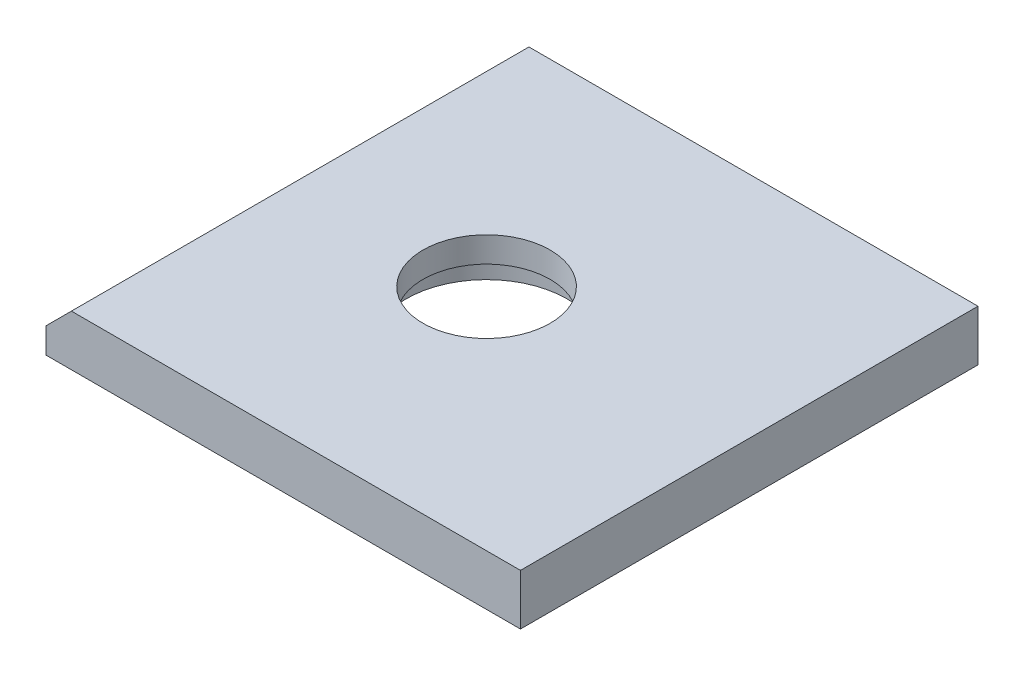
ISO-10303-21;
HEADER;
FILE_DESCRIPTION(('STEP AP214'),'2;1');
FILE_NAME('part.step','',(''),(''),'','','');
FILE_SCHEMA(('AUTOMOTIVE_DESIGN { 1 0 10303 214 1 1 1 1 }'));
ENDSEC;
DATA;
#1=APPLICATION_CONTEXT('core data for automotive mechanical design processes');
#2=APPLICATION_PROTOCOL_DEFINITION('international standard','automotive_design',2000,#1);
#3=PRODUCT_CONTEXT('',#1,'mechanical');
#4=PRODUCT('Part','Part','',(#3));
#5=PRODUCT_RELATED_PRODUCT_CATEGORY('part','',(#4));
#6=PRODUCT_DEFINITION_FORMATION('','',#4);
#7=PRODUCT_DEFINITION_CONTEXT('part definition',#1,'design');
#8=PRODUCT_DEFINITION('design','',#6,#7);
#9=PRODUCT_DEFINITION_SHAPE('','',#8);
#10=(LENGTH_UNIT() NAMED_UNIT(*) SI_UNIT(.MILLI.,.METRE.));
#11=(NAMED_UNIT(*) PLANE_ANGLE_UNIT() SI_UNIT($,.RADIAN.));
#12=(NAMED_UNIT(*) SI_UNIT($,.STERADIAN.) SOLID_ANGLE_UNIT());
#13=UNCERTAINTY_MEASURE_WITH_UNIT(LENGTH_MEASURE(1.E-05),#10,'distance_accuracy_value','');
#14=(GEOMETRIC_REPRESENTATION_CONTEXT(3) GLOBAL_UNCERTAINTY_ASSIGNED_CONTEXT((#13)) GLOBAL_UNIT_ASSIGNED_CONTEXT((#10,
#11,#12)) REPRESENTATION_CONTEXT('',''));
#15=CARTESIAN_POINT('',(0.,0.,0.));
#16=DIRECTION('',(0.,0.,1.));
#17=DIRECTION('',(1.,0.,0.));
#18=AXIS2_PLACEMENT_3D('',#15,#16,#17);
#19=CARTESIAN_POINT('',(-3.,3.,0.));
#20=DIRECTION('',(0.,-1.,0.));
#21=DIRECTION('',(0.,0.,-1.));
#22=AXIS2_PLACEMENT_3D('',#19,#20,#21);
#23=CYLINDRICAL_SURFACE('',#22,7.5);
#24=CARTESIAN_POINT('',(-3.,3.,0.));
#25=DIRECTION('',(0.,-1.,0.));
#26=DIRECTION('',(0.,0.,-1.));
#27=AXIS2_PLACEMENT_3D('',#24,#25,#26);
#28=CIRCLE('',#27,7.5);
#29=CARTESIAN_POINT('',(-3.,3.,-7.5));
#30=VERTEX_POINT('',#29);
#31=EDGE_CURVE('E78',#30,#30,#28,.F.);
#32=ORIENTED_EDGE('',*,*,#31,.F.);
#33=EDGE_LOOP('',(#32));
#34=FACE_BOUND('',#33,.T.);
#35=CARTESIAN_POINT('',(-3.,6.,0.));
#36=DIRECTION('',(0.,-1.,0.));
#37=DIRECTION('',(0.,0.,-1.));
#38=AXIS2_PLACEMENT_3D('',#35,#36,#37);
#39=CIRCLE('',#38,7.5);
#40=CARTESIAN_POINT('',(-3.,6.,-7.5));
#41=VERTEX_POINT('',#40);
#42=EDGE_CURVE('E20',#41,#41,#39,.T.);
#43=ORIENTED_EDGE('',*,*,#42,.F.);
#44=EDGE_LOOP('',(#43));
#45=FACE_BOUND('',#44,.T.);
#46=ADVANCED_FACE('F17',(#34,#45),#23,.F.);
#47=CARTESIAN_POINT('',(0.,6.,0.));
#48=DIRECTION('',(0.,1.,0.));
#49=DIRECTION('',(0.,0.,1.));
#50=AXIS2_PLACEMENT_3D('',#47,#48,#49);
#51=PLANE('',#50);
#52=ORIENTED_EDGE('',*,*,#42,.T.);
#53=EDGE_LOOP('',(#52));
#54=FACE_BOUND('',#53,.T.);
#55=DIRECTION('',(-1.,0.,0.));
#56=VECTOR('',#55,1.);
#57=CARTESIAN_POINT('',(28.,6.,-27.));
#58=LINE('',#57,#56);
#59=CARTESIAN_POINT('',(-25.,6.,-27.));
#60=VERTEX_POINT('',#59);
#61=CARTESIAN_POINT('',(28.,6.,-27.));
#62=VERTEX_POINT('',#61);
#63=EDGE_CURVE('E111',#60,#62,#58,.F.);
#64=ORIENTED_EDGE('',*,*,#63,.F.);
#65=DIRECTION('',(0.,0.,1.));
#66=VECTOR('',#65,1.);
#67=CARTESIAN_POINT('',(-25.,6.,0.));
#68=LINE('',#67,#66);
#69=CARTESIAN_POINT('',(-25.,6.,27.));
#70=VERTEX_POINT('',#69);
#71=EDGE_CURVE('E91',#70,#60,#68,.F.);
#72=ORIENTED_EDGE('',*,*,#71,.F.);
#73=DIRECTION('',(1.,0.,0.));
#74=VECTOR('',#73,1.);
#75=CARTESIAN_POINT('',(-28.,6.,27.));
#76=LINE('',#75,#74);
#77=CARTESIAN_POINT('',(28.,6.,27.));
#78=VERTEX_POINT('',#77);
#79=EDGE_CURVE('E62',#78,#70,#76,.F.);
#80=ORIENTED_EDGE('',*,*,#79,.F.);
#81=DIRECTION('',(0.,0.,-1.));
#82=VECTOR('',#81,1.);
#83=CARTESIAN_POINT('',(28.,6.,27.));
#84=LINE('',#83,#82);
#85=EDGE_CURVE('E83',#62,#78,#84,.F.);
#86=ORIENTED_EDGE('',*,*,#85,.F.);
#87=EDGE_LOOP('',(#64,#72,#80,#86));
#88=FACE_BOUND('',#87,.T.);
#89=ADVANCED_FACE('F103',(#54,#88),#51,.T.);
#90=CARTESIAN_POINT('',(-26.5,4.5,0.));
#91=DIRECTION('',(-0.707106781186548,0.707106781186548,0.));
#92=DIRECTION('',(-0.707106781186548,-0.707106781186548,0.));
#93=AXIS2_PLACEMENT_3D('',#90,#91,#92);
#94=PLANE('',#93);
#95=DIRECTION('',(0.,0.,1.));
#96=VECTOR('',#95,1.);
#97=CARTESIAN_POINT('',(-28.,3.,-27.));
#98=LINE('',#97,#96);
#99=CARTESIAN_POINT('',(-28.,3.,27.));
#100=VERTEX_POINT('',#99);
#101=CARTESIAN_POINT('',(-28.,3.,-27.));
#102=VERTEX_POINT('',#101);
#103=EDGE_CURVE('E68',#100,#102,#98,.F.);
#104=ORIENTED_EDGE('',*,*,#103,.F.);
#105=DIRECTION('',(-0.707106781186547,-0.707106781186548,0.));
#106=VECTOR('',#105,1.);
#107=CARTESIAN_POINT('',(-25.,6.,27.));
#108=LINE('',#107,#106);
#109=EDGE_CURVE('E70',#70,#100,#108,.T.);
#110=ORIENTED_EDGE('',*,*,#109,.F.);
#111=ORIENTED_EDGE('',*,*,#71,.T.);
#112=DIRECTION('',(0.707106781186547,0.707106781186548,0.));
#113=VECTOR('',#112,1.);
#114=CARTESIAN_POINT('',(-28.,3.,-27.));
#115=LINE('',#114,#113);
#116=EDGE_CURVE('E72',#102,#60,#115,.T.);
#117=ORIENTED_EDGE('',*,*,#116,.F.);
#118=EDGE_LOOP('',(#104,#110,#111,#117));
#119=FACE_BOUND('',#118,.T.);
#120=ADVANCED_FACE('F69',(#119),#94,.T.);
#121=CARTESIAN_POINT('',(28.,3.,-95.));
#122=DIRECTION('',(0.,-1.,0.));
#123=DIRECTION('',(0.,0.,-1.));
#124=AXIS2_PLACEMENT_3D('',#121,#122,#123);
#125=PLANE('',#124);
#126=ORIENTED_EDGE('',*,*,#31,.T.);
#127=EDGE_LOOP('',(#126));
#128=FACE_BOUND('',#127,.T.);
#129=CARTESIAN_POINT('',(-3.,3.,0.));
#130=DIRECTION('',(0.,-1.,0.));
#131=DIRECTION('',(0.,0.,-1.));
#132=AXIS2_PLACEMENT_3D('',#129,#130,#131);
#133=CIRCLE('',#132,9.5);
#134=CARTESIAN_POINT('',(-3.,3.,-9.5));
#135=VERTEX_POINT('',#134);
#136=EDGE_CURVE('E93',#135,#135,#133,.T.);
#137=ORIENTED_EDGE('',*,*,#136,.T.);
#138=EDGE_LOOP('',(#137));
#139=FACE_BOUND('',#138,.T.);
#140=ADVANCED_FACE('F98',(#128,#139),#125,.T.);
#141=CARTESIAN_POINT('',(-28.,0.,-27.));
#142=DIRECTION('',(-1.,0.,0.));
#143=DIRECTION('',(0.,0.,1.));
#144=AXIS2_PLACEMENT_3D('',#141,#142,#143);
#145=PLANE('',#144);
#146=DIRECTION('',(0.,1.,0.));
#147=VECTOR('',#146,1.);
#148=CARTESIAN_POINT('',(-28.,0.,27.));
#149=LINE('',#148,#147);
#150=CARTESIAN_POINT('',(-28.,0.,27.));
#151=VERTEX_POINT('',#150);
#152=EDGE_CURVE('E77',#100,#151,#149,.F.);
#153=ORIENTED_EDGE('',*,*,#152,.F.);
#154=ORIENTED_EDGE('',*,*,#103,.T.);
#155=DIRECTION('',(0.,1.,0.));
#156=VECTOR('',#155,1.);
#157=CARTESIAN_POINT('',(-28.,0.,-27.));
#158=LINE('',#157,#156);
#159=CARTESIAN_POINT('',(-28.,0.,-27.));
#160=VERTEX_POINT('',#159);
#161=EDGE_CURVE('E114',#160,#102,#158,.T.);
#162=ORIENTED_EDGE('',*,*,#161,.F.);
#163=DIRECTION('',(0.,0.,1.));
#164=VECTOR('',#163,1.);
#165=CARTESIAN_POINT('',(-28.,0.,0.));
#166=LINE('',#165,#164);
#167=EDGE_CURVE('E87',#160,#151,#166,.T.);
#168=ORIENTED_EDGE('',*,*,#167,.T.);
#169=EDGE_LOOP('',(#153,#154,#162,#168));
#170=FACE_BOUND('',#169,.T.);
#171=ADVANCED_FACE('F86',(#170),#145,.T.);
#172=CARTESIAN_POINT('',(-28.,0.,27.));
#173=DIRECTION('',(0.,0.,1.));
#174=DIRECTION('',(1.,0.,0.));
#175=AXIS2_PLACEMENT_3D('',#172,#173,#174);
#176=PLANE('',#175);
#177=ORIENTED_EDGE('',*,*,#79,.T.);
#178=ORIENTED_EDGE('',*,*,#109,.T.);
#179=ORIENTED_EDGE('',*,*,#152,.T.);
#180=DIRECTION('',(1.,0.,0.));
#181=VECTOR('',#180,1.);
#182=CARTESIAN_POINT('',(0.,0.,27.));
#183=LINE('',#182,#181);
#184=CARTESIAN_POINT('',(28.,0.,27.));
#185=VERTEX_POINT('',#184);
#186=EDGE_CURVE('E123',#151,#185,#183,.T.);
#187=ORIENTED_EDGE('',*,*,#186,.T.);
#188=DIRECTION('',(0.,1.,0.));
#189=VECTOR('',#188,1.);
#190=CARTESIAN_POINT('',(28.,0.,27.));
#191=LINE('',#190,#189);
#192=EDGE_CURVE('E112',#78,#185,#191,.F.);
#193=ORIENTED_EDGE('',*,*,#192,.F.);
#194=EDGE_LOOP('',(#177,#178,#179,#187,#193));
#195=FACE_BOUND('',#194,.T.);
#196=ADVANCED_FACE('F80',(#195),#176,.T.);
#197=CARTESIAN_POINT('',(28.,0.,27.));
#198=DIRECTION('',(1.,0.,0.));
#199=DIRECTION('',(0.,0.,-1.));
#200=AXIS2_PLACEMENT_3D('',#197,#198,#199);
#201=PLANE('',#200);
#202=ORIENTED_EDGE('',*,*,#192,.T.);
#203=DIRECTION('',(0.,0.,1.));
#204=VECTOR('',#203,1.);
#205=CARTESIAN_POINT('',(28.,0.,0.));
#206=LINE('',#205,#204);
#207=CARTESIAN_POINT('',(28.,0.,-27.));
#208=VERTEX_POINT('',#207);
#209=EDGE_CURVE('E125',#185,#208,#206,.F.);
#210=ORIENTED_EDGE('',*,*,#209,.T.);
#211=DIRECTION('',(0.,1.,0.));
#212=VECTOR('',#211,1.);
#213=CARTESIAN_POINT('',(28.,0.,-27.));
#214=LINE('',#213,#212);
#215=EDGE_CURVE('E35',#62,#208,#214,.F.);
#216=ORIENTED_EDGE('',*,*,#215,.F.);
#217=ORIENTED_EDGE('',*,*,#85,.T.);
#218=EDGE_LOOP('',(#202,#210,#216,#217));
#219=FACE_BOUND('',#218,.T.);
#220=ADVANCED_FACE('F120',(#219),#201,.T.);
#221=CARTESIAN_POINT('',(28.,0.,-27.));
#222=DIRECTION('',(0.,0.,-1.));
#223=DIRECTION('',(-1.,0.,0.));
#224=AXIS2_PLACEMENT_3D('',#221,#222,#223);
#225=PLANE('',#224);
#226=ORIENTED_EDGE('',*,*,#161,.T.);
#227=ORIENTED_EDGE('',*,*,#116,.T.);
#228=ORIENTED_EDGE('',*,*,#63,.T.);
#229=ORIENTED_EDGE('',*,*,#215,.T.);
#230=DIRECTION('',(1.,0.,0.));
#231=VECTOR('',#230,1.);
#232=CARTESIAN_POINT('',(0.,0.,-27.));
#233=LINE('',#232,#231);
#234=EDGE_CURVE('E26',#208,#160,#233,.F.);
#235=ORIENTED_EDGE('',*,*,#234,.T.);
#236=EDGE_LOOP('',(#226,#227,#228,#229,#235));
#237=FACE_BOUND('',#236,.T.);
#238=ADVANCED_FACE('F131',(#237),#225,.T.);
#239=CARTESIAN_POINT('',(-3.,0.,0.));
#240=DIRECTION('',(0.,-1.,0.));
#241=DIRECTION('',(0.,0.,-1.));
#242=AXIS2_PLACEMENT_3D('',#239,#240,#241);
#243=CYLINDRICAL_SURFACE('',#242,9.5);
#244=ORIENTED_EDGE('',*,*,#136,.F.);
#245=EDGE_LOOP('',(#244));
#246=FACE_BOUND('',#245,.T.);
#247=CARTESIAN_POINT('',(-3.,0.,0.));
#248=DIRECTION('',(0.,-1.,0.));
#249=DIRECTION('',(0.,0.,-1.));
#250=AXIS2_PLACEMENT_3D('',#247,#248,#249);
#251=CIRCLE('',#250,9.5);
#252=CARTESIAN_POINT('',(-3.,0.,-9.5));
#253=VERTEX_POINT('',#252);
#254=EDGE_CURVE('E11',#253,#253,#251,.T.);
#255=ORIENTED_EDGE('',*,*,#254,.T.);
#256=EDGE_LOOP('',(#255));
#257=FACE_BOUND('',#256,.T.);
#258=ADVANCED_FACE('F134',(#246,#257),#243,.F.);
#259=CARTESIAN_POINT('',(0.,0.,0.));
#260=DIRECTION('',(0.,1.,0.));
#261=DIRECTION('',(0.,0.,1.));
#262=AXIS2_PLACEMENT_3D('',#259,#260,#261);
#263=PLANE('',#262);
#264=ORIENTED_EDGE('',*,*,#254,.F.);
#265=EDGE_LOOP('',(#264));
#266=FACE_BOUND('',#265,.T.);
#267=ORIENTED_EDGE('',*,*,#209,.F.);
#268=ORIENTED_EDGE('',*,*,#186,.F.);
#269=ORIENTED_EDGE('',*,*,#167,.F.);
#270=ORIENTED_EDGE('',*,*,#234,.F.);
#271=EDGE_LOOP('',(#267,#268,#269,#270));
#272=FACE_BOUND('',#271,.T.);
#273=ADVANCED_FACE('F132',(#266,#272),#263,.F.);
#274=CLOSED_SHELL('',(#46,#89,#120,#140,#171,#196,#220,#238,#258,#273));
#275=MANIFOLD_SOLID_BREP('B1',#274);
#276=ADVANCED_BREP_SHAPE_REPRESENTATION('',(#18,#275),#14);
#277=SHAPE_DEFINITION_REPRESENTATION(#9,#276);
ENDSEC;
END-ISO-10303-21;
